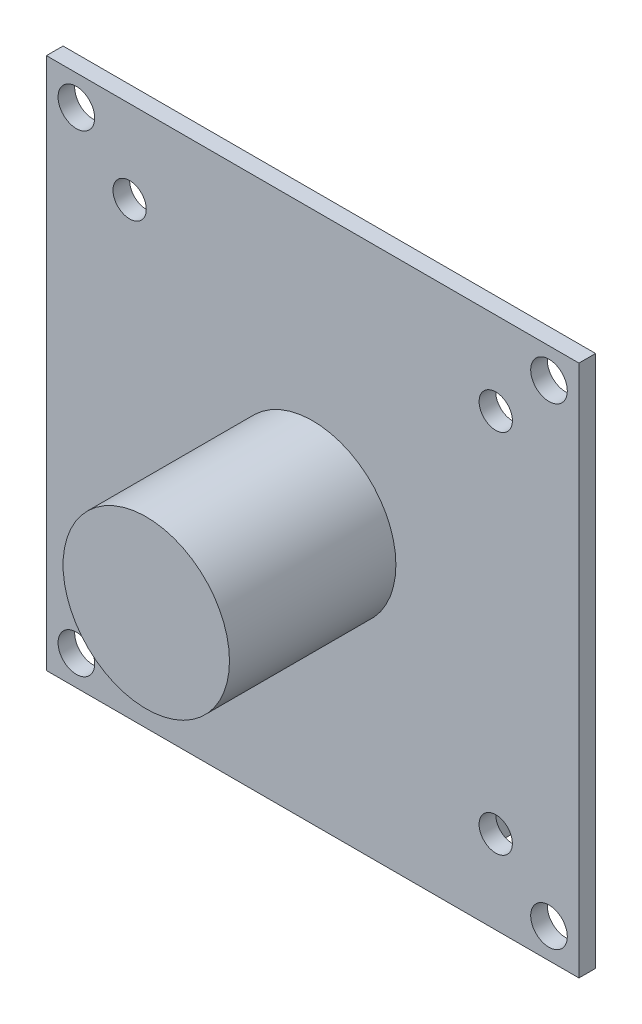
ISO-10303-21;
HEADER;
FILE_DESCRIPTION(('STEP AP214'),'2;1');
FILE_NAME('part.step','',(''),(''),'','','');
FILE_SCHEMA(('AUTOMOTIVE_DESIGN { 1 0 10303 214 1 1 1 1 }'));
ENDSEC;
DATA;
#1=APPLICATION_CONTEXT('core data for automotive mechanical design processes');
#2=APPLICATION_PROTOCOL_DEFINITION('international standard','automotive_design',2000,#1);
#3=PRODUCT_CONTEXT('',#1,'mechanical');
#4=PRODUCT('Part','Part','',(#3));
#5=PRODUCT_RELATED_PRODUCT_CATEGORY('part','',(#4));
#6=PRODUCT_DEFINITION_FORMATION('','',#4);
#7=PRODUCT_DEFINITION_CONTEXT('part definition',#1,'design');
#8=PRODUCT_DEFINITION('design','',#6,#7);
#9=PRODUCT_DEFINITION_SHAPE('','',#8);
#10=(LENGTH_UNIT() NAMED_UNIT(*) SI_UNIT(.MILLI.,.METRE.));
#11=(NAMED_UNIT(*) PLANE_ANGLE_UNIT() SI_UNIT($,.RADIAN.));
#12=(NAMED_UNIT(*) SI_UNIT($,.STERADIAN.) SOLID_ANGLE_UNIT());
#13=UNCERTAINTY_MEASURE_WITH_UNIT(LENGTH_MEASURE(1.E-05),#10,'distance_accuracy_value','');
#14=(GEOMETRIC_REPRESENTATION_CONTEXT(3) GLOBAL_UNCERTAINTY_ASSIGNED_CONTEXT((#13)) GLOBAL_UNIT_ASSIGNED_CONTEXT((#10,
#11,#12)) REPRESENTATION_CONTEXT('',''));
#15=CARTESIAN_POINT('',(0.,0.,0.));
#16=DIRECTION('',(0.,0.,1.));
#17=DIRECTION('',(1.,0.,0.));
#18=AXIS2_PLACEMENT_3D('',#15,#16,#17);
#19=CARTESIAN_POINT('',(0.,0.,0.));
#20=DIRECTION('',(0.,0.,1.));
#21=DIRECTION('',(1.,0.,0.));
#22=AXIS2_PLACEMENT_3D('',#19,#20,#21);
#23=PLANE('',#22);
#24=CARTESIAN_POINT('',(-14.2,-14.2,0.));
#25=DIRECTION('',(0.,0.,1.));
#26=DIRECTION('',(1.,0.,0.));
#27=AXIS2_PLACEMENT_3D('',#24,#25,#26);
#28=CIRCLE('',#27,1.1);
#29=CARTESIAN_POINT('',(-13.1,-14.2,0.));
#30=VERTEX_POINT('',#29);
#31=EDGE_CURVE('E327',#30,#30,#28,.T.);
#32=ORIENTED_EDGE('',*,*,#31,.T.);
#33=EDGE_LOOP('',(#32));
#34=FACE_BOUND('',#33,.T.);
#35=CARTESIAN_POINT('',(14.2,-14.2,0.));
#36=DIRECTION('',(0.,0.,1.));
#37=DIRECTION('',(1.,0.,0.));
#38=AXIS2_PLACEMENT_3D('',#35,#36,#37);
#39=CIRCLE('',#38,1.1);
#40=CARTESIAN_POINT('',(15.3,-14.2,0.));
#41=VERTEX_POINT('',#40);
#42=EDGE_CURVE('E321',#41,#41,#39,.T.);
#43=ORIENTED_EDGE('',*,*,#42,.T.);
#44=EDGE_LOOP('',(#43));
#45=FACE_BOUND('',#44,.T.);
#46=CARTESIAN_POINT('',(14.2,14.2,0.));
#47=DIRECTION('',(0.,0.,1.));
#48=DIRECTION('',(1.,0.,0.));
#49=AXIS2_PLACEMENT_3D('',#46,#47,#48);
#50=CIRCLE('',#49,1.1);
#51=CARTESIAN_POINT('',(15.3,14.2,0.));
#52=VERTEX_POINT('',#51);
#53=EDGE_CURVE('E318',#52,#52,#50,.T.);
#54=ORIENTED_EDGE('',*,*,#53,.T.);
#55=EDGE_LOOP('',(#54));
#56=FACE_BOUND('',#55,.T.);
#57=CARTESIAN_POINT('',(-14.2,14.2,0.));
#58=DIRECTION('',(0.,0.,1.));
#59=DIRECTION('',(1.,0.,0.));
#60=AXIS2_PLACEMENT_3D('',#57,#58,#59);
#61=CIRCLE('',#60,1.1);
#62=CARTESIAN_POINT('',(-13.1,14.2,0.));
#63=VERTEX_POINT('',#62);
#64=EDGE_CURVE('E322',#63,#63,#61,.T.);
#65=ORIENTED_EDGE('',*,*,#64,.T.);
#66=EDGE_LOOP('',(#65));
#67=FACE_BOUND('',#66,.T.);
#68=CARTESIAN_POINT('',(-11.,-11.,0.));
#69=DIRECTION('',(0.,0.,-1.));
#70=DIRECTION('',(-1.,0.,0.));
#71=AXIS2_PLACEMENT_3D('',#68,#69,#70);
#72=CIRCLE('',#71,1.);
#73=CARTESIAN_POINT('',(-12.,-11.,0.));
#74=VERTEX_POINT('',#73);
#75=EDGE_CURVE('E141',#74,#74,#72,.T.);
#76=ORIENTED_EDGE('',*,*,#75,.F.);
#77=EDGE_LOOP('',(#76));
#78=FACE_BOUND('',#77,.T.);
#79=CARTESIAN_POINT('',(11.,-11.,0.));
#80=DIRECTION('',(0.,0.,-1.));
#81=DIRECTION('',(-1.,0.,0.));
#82=AXIS2_PLACEMENT_3D('',#79,#80,#81);
#83=CIRCLE('',#82,1.);
#84=CARTESIAN_POINT('',(10.,-11.,0.));
#85=VERTEX_POINT('',#84);
#86=EDGE_CURVE('E156',#85,#85,#83,.T.);
#87=ORIENTED_EDGE('',*,*,#86,.F.);
#88=EDGE_LOOP('',(#87));
#89=FACE_BOUND('',#88,.T.);
#90=DIRECTION('',(0.,-1.,0.));
#91=VECTOR('',#90,1.);
#92=CARTESIAN_POINT('',(-16.,-16.,0.));
#93=LINE('',#92,#91);
#94=CARTESIAN_POINT('',(-16.,16.,0.));
#95=VERTEX_POINT('',#94);
#96=CARTESIAN_POINT('',(-16.,-16.,0.));
#97=VERTEX_POINT('',#96);
#98=EDGE_CURVE('E171',#95,#97,#93,.T.);
#99=ORIENTED_EDGE('',*,*,#98,.F.);
#100=DIRECTION('',(-1.,0.,0.));
#101=VECTOR('',#100,1.);
#102=CARTESIAN_POINT('',(16.,16.,0.));
#103=LINE('',#102,#101);
#104=CARTESIAN_POINT('',(16.,16.,0.));
#105=VERTEX_POINT('',#104);
#106=EDGE_CURVE('E180',#105,#95,#103,.T.);
#107=ORIENTED_EDGE('',*,*,#106,.F.);
#108=DIRECTION('',(0.,1.,0.));
#109=VECTOR('',#108,1.);
#110=CARTESIAN_POINT('',(16.,-16.,0.));
#111=LINE('',#110,#109);
#112=CARTESIAN_POINT('',(16.,-16.,0.));
#113=VERTEX_POINT('',#112);
#114=EDGE_CURVE('E196',#113,#105,#111,.T.);
#115=ORIENTED_EDGE('',*,*,#114,.F.);
#116=DIRECTION('',(1.,0.,0.));
#117=VECTOR('',#116,1.);
#118=CARTESIAN_POINT('',(16.,-16.,0.));
#119=LINE('',#118,#117);
#120=EDGE_CURVE('E193',#97,#113,#119,.T.);
#121=ORIENTED_EDGE('',*,*,#120,.F.);
#122=EDGE_LOOP('',(#99,#107,#115,#121));
#123=FACE_BOUND('',#122,.T.);
#124=CARTESIAN_POINT('',(-11.,11.,0.));
#125=DIRECTION('',(0.,0.,1.));
#126=DIRECTION('',(1.,0.,0.));
#127=AXIS2_PLACEMENT_3D('',#124,#125,#126);
#128=CIRCLE('',#127,1.);
#129=CARTESIAN_POINT('',(-10.,11.,0.));
#130=VERTEX_POINT('',#129);
#131=EDGE_CURVE('E167',#130,#130,#128,.T.);
#132=ORIENTED_EDGE('',*,*,#131,.T.);
#133=EDGE_LOOP('',(#132));
#134=FACE_BOUND('',#133,.T.);
#135=CARTESIAN_POINT('',(11.,11.,0.));
#136=DIRECTION('',(0.,0.,1.));
#137=DIRECTION('',(1.,0.,0.));
#138=AXIS2_PLACEMENT_3D('',#135,#136,#137);
#139=CIRCLE('',#138,1.);
#140=CARTESIAN_POINT('',(12.,11.,0.));
#141=VERTEX_POINT('',#140);
#142=EDGE_CURVE('E148',#141,#141,#139,.T.);
#143=ORIENTED_EDGE('',*,*,#142,.T.);
#144=EDGE_LOOP('',(#143));
#145=FACE_BOUND('',#144,.T.);
#146=DIRECTION('',(0.,1.,0.));
#147=VECTOR('',#146,1.);
#148=CARTESIAN_POINT('',(-2.,-10.,0.));
#149=LINE('',#148,#147);
#150=CARTESIAN_POINT('',(-2.,-14.5,0.));
#151=VERTEX_POINT('',#150);
#152=CARTESIAN_POINT('',(-2.,-10.,0.));
#153=VERTEX_POINT('',#152);
#154=EDGE_CURVE('E126',#151,#153,#149,.T.);
#155=ORIENTED_EDGE('',*,*,#154,.F.);
#156=DIRECTION('',(-1.,0.,0.));
#157=VECTOR('',#156,1.);
#158=CARTESIAN_POINT('',(8.,-14.5,0.));
#159=LINE('',#158,#157);
#160=CARTESIAN_POINT('',(8.,-14.5,0.));
#161=VERTEX_POINT('',#160);
#162=EDGE_CURVE('E123',#161,#151,#159,.T.);
#163=ORIENTED_EDGE('',*,*,#162,.F.);
#164=DIRECTION('',(0.,-1.,0.));
#165=VECTOR('',#164,1.);
#166=CARTESIAN_POINT('',(8.,-10.,0.));
#167=LINE('',#166,#165);
#168=CARTESIAN_POINT('',(8.,-10.,0.));
#169=VERTEX_POINT('',#168);
#170=EDGE_CURVE('E59',#169,#161,#167,.T.);
#171=ORIENTED_EDGE('',*,*,#170,.F.);
#172=DIRECTION('',(1.,0.,0.));
#173=VECTOR('',#172,1.);
#174=CARTESIAN_POINT('',(8.,-10.,0.));
#175=LINE('',#174,#173);
#176=EDGE_CURVE('E54',#153,#169,#175,.T.);
#177=ORIENTED_EDGE('',*,*,#176,.F.);
#178=EDGE_LOOP('',(#155,#163,#171,#177));
#179=FACE_BOUND('',#178,.T.);
#180=ADVANCED_FACE('F38',(#34,#45,#56,#67,#78,#89,#123,#134,#145,#179),#23,.F.);
#181=CARTESIAN_POINT('',(0.,0.,1.));
#182=DIRECTION('',(0.,0.,1.));
#183=DIRECTION('',(1.,0.,0.));
#184=AXIS2_PLACEMENT_3D('',#181,#182,#183);
#185=PLANE('',#184);
#186=CARTESIAN_POINT('',(-14.2,-14.2,1.));
#187=DIRECTION('',(0.,0.,1.));
#188=DIRECTION('',(-1.,0.,0.));
#189=AXIS2_PLACEMENT_3D('',#186,#187,#188);
#190=CIRCLE('',#189,1.1);
#191=CARTESIAN_POINT('',(-15.3,-14.2,1.));
#192=VERTEX_POINT('',#191);
#193=EDGE_CURVE('E359',#192,#192,#190,.T.);
#194=ORIENTED_EDGE('',*,*,#193,.F.);
#195=EDGE_LOOP('',(#194));
#196=FACE_BOUND('',#195,.T.);
#197=CARTESIAN_POINT('',(14.2,-14.2,1.));
#198=DIRECTION('',(0.,0.,1.));
#199=DIRECTION('',(1.,0.,0.));
#200=AXIS2_PLACEMENT_3D('',#197,#198,#199);
#201=CIRCLE('',#200,1.1);
#202=CARTESIAN_POINT('',(15.3,-14.2,1.));
#203=VERTEX_POINT('',#202);
#204=EDGE_CURVE('E363',#203,#203,#201,.T.);
#205=ORIENTED_EDGE('',*,*,#204,.F.);
#206=EDGE_LOOP('',(#205));
#207=FACE_BOUND('',#206,.T.);
#208=CARTESIAN_POINT('',(14.2,14.2,1.));
#209=DIRECTION('',(0.,0.,1.));
#210=DIRECTION('',(-1.,0.,0.));
#211=AXIS2_PLACEMENT_3D('',#208,#209,#210);
#212=CIRCLE('',#211,1.1);
#213=CARTESIAN_POINT('',(13.1,14.2,1.));
#214=VERTEX_POINT('',#213);
#215=EDGE_CURVE('E315',#214,#214,#212,.T.);
#216=ORIENTED_EDGE('',*,*,#215,.F.);
#217=EDGE_LOOP('',(#216));
#218=FACE_BOUND('',#217,.T.);
#219=CARTESIAN_POINT('',(-14.2,14.2,1.));
#220=DIRECTION('',(0.,0.,1.));
#221=DIRECTION('',(1.,0.,0.));
#222=AXIS2_PLACEMENT_3D('',#219,#220,#221);
#223=CIRCLE('',#222,1.1);
#224=CARTESIAN_POINT('',(-13.1,14.2,1.));
#225=VERTEX_POINT('',#224);
#226=EDGE_CURVE('E330',#225,#225,#223,.T.);
#227=ORIENTED_EDGE('',*,*,#226,.F.);
#228=EDGE_LOOP('',(#227));
#229=FACE_BOUND('',#228,.T.);
#230=CARTESIAN_POINT('',(0.,0.,1.));
#231=DIRECTION('',(0.,0.,1.));
#232=DIRECTION('',(1.,0.,0.));
#233=AXIS2_PLACEMENT_3D('',#230,#231,#232);
#234=CIRCLE('',#233,5.);
#235=CARTESIAN_POINT('',(5.,0.,1.));
#236=VERTEX_POINT('',#235);
#237=EDGE_CURVE('E128',#236,#236,#234,.T.);
#238=ORIENTED_EDGE('',*,*,#237,.F.);
#239=EDGE_LOOP('',(#238));
#240=FACE_BOUND('',#239,.T.);
#241=CARTESIAN_POINT('',(11.,-11.,1.));
#242=DIRECTION('',(0.,0.,-1.));
#243=DIRECTION('',(-1.,0.,0.));
#244=AXIS2_PLACEMENT_3D('',#241,#242,#243);
#245=CIRCLE('',#244,1.);
#246=CARTESIAN_POINT('',(10.,-11.,1.));
#247=VERTEX_POINT('',#246);
#248=EDGE_CURVE('E152',#247,#247,#245,.T.);
#249=ORIENTED_EDGE('',*,*,#248,.T.);
#250=EDGE_LOOP('',(#249));
#251=FACE_BOUND('',#250,.T.);
#252=CARTESIAN_POINT('',(11.,11.,1.));
#253=DIRECTION('',(0.,0.,1.));
#254=DIRECTION('',(1.,0.,0.));
#255=AXIS2_PLACEMENT_3D('',#252,#253,#254);
#256=CIRCLE('',#255,1.);
#257=CARTESIAN_POINT('',(12.,11.,1.));
#258=VERTEX_POINT('',#257);
#259=EDGE_CURVE('E143',#258,#258,#256,.T.);
#260=ORIENTED_EDGE('',*,*,#259,.F.);
#261=EDGE_LOOP('',(#260));
#262=FACE_BOUND('',#261,.T.);
#263=CARTESIAN_POINT('',(-11.,11.,1.));
#264=DIRECTION('',(0.,0.,1.));
#265=DIRECTION('',(1.,0.,0.));
#266=AXIS2_PLACEMENT_3D('',#263,#264,#265);
#267=CIRCLE('',#266,1.);
#268=CARTESIAN_POINT('',(-10.,11.,1.));
#269=VERTEX_POINT('',#268);
#270=EDGE_CURVE('E147',#269,#269,#267,.T.);
#271=ORIENTED_EDGE('',*,*,#270,.F.);
#272=EDGE_LOOP('',(#271));
#273=FACE_BOUND('',#272,.T.);
#274=DIRECTION('',(0.,-1.,0.));
#275=VECTOR('',#274,1.);
#276=CARTESIAN_POINT('',(-16.,-16.,1.));
#277=LINE('',#276,#275);
#278=CARTESIAN_POINT('',(-16.,16.,1.));
#279=VERTEX_POINT('',#278);
#280=CARTESIAN_POINT('',(-16.,-16.,1.));
#281=VERTEX_POINT('',#280);
#282=EDGE_CURVE('E175',#279,#281,#277,.T.);
#283=ORIENTED_EDGE('',*,*,#282,.T.);
#284=DIRECTION('',(1.,0.,0.));
#285=VECTOR('',#284,1.);
#286=CARTESIAN_POINT('',(16.,-16.,1.));
#287=LINE('',#286,#285);
#288=CARTESIAN_POINT('',(16.,-16.,1.));
#289=VERTEX_POINT('',#288);
#290=EDGE_CURVE('E179',#281,#289,#287,.T.);
#291=ORIENTED_EDGE('',*,*,#290,.T.);
#292=DIRECTION('',(0.,1.,0.));
#293=VECTOR('',#292,1.);
#294=CARTESIAN_POINT('',(16.,-16.,1.));
#295=LINE('',#294,#293);
#296=CARTESIAN_POINT('',(16.,16.,1.));
#297=VERTEX_POINT('',#296);
#298=EDGE_CURVE('E183',#289,#297,#295,.T.);
#299=ORIENTED_EDGE('',*,*,#298,.T.);
#300=DIRECTION('',(-1.,0.,0.));
#301=VECTOR('',#300,1.);
#302=CARTESIAN_POINT('',(16.,16.,1.));
#303=LINE('',#302,#301);
#304=EDGE_CURVE('E186',#297,#279,#303,.T.);
#305=ORIENTED_EDGE('',*,*,#304,.T.);
#306=EDGE_LOOP('',(#283,#291,#299,#305));
#307=FACE_BOUND('',#306,.T.);
#308=CARTESIAN_POINT('',(-11.,-11.,1.));
#309=DIRECTION('',(0.,0.,-1.));
#310=DIRECTION('',(-1.,0.,0.));
#311=AXIS2_PLACEMENT_3D('',#308,#309,#310);
#312=CIRCLE('',#311,1.);
#313=CARTESIAN_POINT('',(-12.,-11.,1.));
#314=VERTEX_POINT('',#313);
#315=EDGE_CURVE('E160',#314,#314,#312,.T.);
#316=ORIENTED_EDGE('',*,*,#315,.T.);
#317=EDGE_LOOP('',(#316));
#318=FACE_BOUND('',#317,.T.);
#319=ADVANCED_FACE('F228',(#196,#207,#218,#229,#240,#251,#262,#273,#307,#318),#185,.T.);
#320=CARTESIAN_POINT('',(-16.,-16.,1.));
#321=DIRECTION('',(1.,0.,0.));
#322=DIRECTION('',(0.,0.,-1.));
#323=AXIS2_PLACEMENT_3D('',#320,#321,#322);
#324=PLANE('',#323);
#325=ORIENTED_EDGE('',*,*,#98,.T.);
#326=DIRECTION('',(0.,0.,-1.));
#327=VECTOR('',#326,1.);
#328=CARTESIAN_POINT('',(-16.,-16.,1.));
#329=LINE('',#328,#327);
#330=EDGE_CURVE('E11',#281,#97,#329,.T.);
#331=ORIENTED_EDGE('',*,*,#330,.F.);
#332=ORIENTED_EDGE('',*,*,#282,.F.);
#333=DIRECTION('',(0.,0.,-1.));
#334=VECTOR('',#333,1.);
#335=CARTESIAN_POINT('',(-16.,16.,1.));
#336=LINE('',#335,#334);
#337=EDGE_CURVE('E189',#279,#95,#336,.T.);
#338=ORIENTED_EDGE('',*,*,#337,.T.);
#339=EDGE_LOOP('',(#325,#331,#332,#338));
#340=FACE_BOUND('',#339,.T.);
#341=ADVANCED_FACE('F40',(#340),#324,.F.);
#342=CARTESIAN_POINT('',(16.,-16.,1.));
#343=DIRECTION('',(0.,1.,0.));
#344=DIRECTION('',(-1.,0.,0.));
#345=AXIS2_PLACEMENT_3D('',#342,#343,#344);
#346=PLANE('',#345);
#347=ORIENTED_EDGE('',*,*,#120,.T.);
#348=DIRECTION('',(0.,0.,-1.));
#349=VECTOR('',#348,1.);
#350=CARTESIAN_POINT('',(16.,-16.,1.));
#351=LINE('',#350,#349);
#352=EDGE_CURVE('E47',#289,#113,#351,.T.);
#353=ORIENTED_EDGE('',*,*,#352,.F.);
#354=ORIENTED_EDGE('',*,*,#290,.F.);
#355=ORIENTED_EDGE('',*,*,#330,.T.);
#356=EDGE_LOOP('',(#347,#353,#354,#355));
#357=FACE_BOUND('',#356,.T.);
#358=ADVANCED_FACE('F230',(#357),#346,.F.);
#359=CARTESIAN_POINT('',(16.,-16.,1.));
#360=DIRECTION('',(-1.,0.,0.));
#361=DIRECTION('',(0.,0.,1.));
#362=AXIS2_PLACEMENT_3D('',#359,#360,#361);
#363=PLANE('',#362);
#364=ORIENTED_EDGE('',*,*,#114,.T.);
#365=DIRECTION('',(0.,0.,-1.));
#366=VECTOR('',#365,1.);
#367=CARTESIAN_POINT('',(16.,16.,1.));
#368=LINE('',#367,#366);
#369=EDGE_CURVE('E204',#297,#105,#368,.T.);
#370=ORIENTED_EDGE('',*,*,#369,.F.);
#371=ORIENTED_EDGE('',*,*,#298,.F.);
#372=ORIENTED_EDGE('',*,*,#352,.T.);
#373=EDGE_LOOP('',(#364,#370,#371,#372));
#374=FACE_BOUND('',#373,.T.);
#375=ADVANCED_FACE('F213',(#374),#363,.F.);
#376=CARTESIAN_POINT('',(16.,16.,1.));
#377=DIRECTION('',(0.,-1.,0.));
#378=DIRECTION('',(0.,0.,-1.));
#379=AXIS2_PLACEMENT_3D('',#376,#377,#378);
#380=PLANE('',#379);
#381=ORIENTED_EDGE('',*,*,#106,.T.);
#382=ORIENTED_EDGE('',*,*,#337,.F.);
#383=ORIENTED_EDGE('',*,*,#304,.F.);
#384=ORIENTED_EDGE('',*,*,#369,.T.);
#385=EDGE_LOOP('',(#381,#382,#383,#384));
#386=FACE_BOUND('',#385,.T.);
#387=ADVANCED_FACE('F222',(#386),#380,.F.);
#388=CARTESIAN_POINT('',(-11.,11.,0.));
#389=DIRECTION('',(0.,0.,1.));
#390=DIRECTION('',(1.,0.,0.));
#391=AXIS2_PLACEMENT_3D('',#388,#389,#390);
#392=CYLINDRICAL_SURFACE('',#391,1.);
#393=ORIENTED_EDGE('',*,*,#131,.F.);
#394=EDGE_LOOP('',(#393));
#395=FACE_BOUND('',#394,.T.);
#396=ORIENTED_EDGE('',*,*,#270,.T.);
#397=EDGE_LOOP('',(#396));
#398=FACE_BOUND('',#397,.T.);
#399=ADVANCED_FACE('F251',(#395,#398),#392,.F.);
#400=CARTESIAN_POINT('',(11.,11.,0.));
#401=DIRECTION('',(0.,0.,1.));
#402=DIRECTION('',(1.,0.,0.));
#403=AXIS2_PLACEMENT_3D('',#400,#401,#402);
#404=CYLINDRICAL_SURFACE('',#403,1.);
#405=ORIENTED_EDGE('',*,*,#142,.F.);
#406=EDGE_LOOP('',(#405));
#407=FACE_BOUND('',#406,.T.);
#408=ORIENTED_EDGE('',*,*,#259,.T.);
#409=EDGE_LOOP('',(#408));
#410=FACE_BOUND('',#409,.T.);
#411=ADVANCED_FACE('F255',(#407,#410),#404,.F.);
#412=CARTESIAN_POINT('',(11.,-11.,0.));
#413=DIRECTION('',(0.,0.,1.));
#414=DIRECTION('',(1.,0.,0.));
#415=AXIS2_PLACEMENT_3D('',#412,#413,#414);
#416=CYLINDRICAL_SURFACE('',#415,1.);
#417=ORIENTED_EDGE('',*,*,#86,.T.);
#418=EDGE_LOOP('',(#417));
#419=FACE_BOUND('',#418,.T.);
#420=ORIENTED_EDGE('',*,*,#248,.F.);
#421=EDGE_LOOP('',(#420));
#422=FACE_BOUND('',#421,.T.);
#423=ADVANCED_FACE('F260',(#419,#422),#416,.F.);
#424=CARTESIAN_POINT('',(-11.,-11.,0.));
#425=DIRECTION('',(0.,0.,1.));
#426=DIRECTION('',(1.,0.,0.));
#427=AXIS2_PLACEMENT_3D('',#424,#425,#426);
#428=CYLINDRICAL_SURFACE('',#427,1.);
#429=ORIENTED_EDGE('',*,*,#75,.T.);
#430=EDGE_LOOP('',(#429));
#431=FACE_BOUND('',#430,.T.);
#432=ORIENTED_EDGE('',*,*,#315,.F.);
#433=EDGE_LOOP('',(#432));
#434=FACE_BOUND('',#433,.T.);
#435=ADVANCED_FACE('F266',(#431,#434),#428,.F.);
#436=CARTESIAN_POINT('',(0.,0.,11.));
#437=DIRECTION('',(0.,0.,-1.));
#438=DIRECTION('',(-1.,0.,0.));
#439=AXIS2_PLACEMENT_3D('',#436,#437,#438);
#440=CYLINDRICAL_SURFACE('',#439,5.);
#441=CARTESIAN_POINT('',(0.,0.,11.));
#442=DIRECTION('',(0.,0.,1.));
#443=DIRECTION('',(1.,0.,0.));
#444=AXIS2_PLACEMENT_3D('',#441,#442,#443);
#445=CIRCLE('',#444,5.);
#446=CARTESIAN_POINT('',(5.,0.,11.));
#447=VERTEX_POINT('',#446);
#448=EDGE_CURVE('E133',#447,#447,#445,.T.);
#449=ORIENTED_EDGE('',*,*,#448,.F.);
#450=EDGE_LOOP('',(#449));
#451=FACE_BOUND('',#450,.T.);
#452=ORIENTED_EDGE('',*,*,#237,.T.);
#453=EDGE_LOOP('',(#452));
#454=FACE_BOUND('',#453,.T.);
#455=ADVANCED_FACE('F269',(#451,#454),#440,.T.);
#456=CARTESIAN_POINT('',(0.,0.,11.));
#457=DIRECTION('',(0.,0.,1.));
#458=DIRECTION('',(1.,0.,0.));
#459=AXIS2_PLACEMENT_3D('',#456,#457,#458);
#460=PLANE('',#459);
#461=ORIENTED_EDGE('',*,*,#448,.T.);
#462=EDGE_LOOP('',(#461));
#463=FACE_BOUND('',#462,.T.);
#464=ADVANCED_FACE('F276',(#463),#460,.T.);
#465=CARTESIAN_POINT('',(-2.,-10.,-6.));
#466=DIRECTION('',(1.,0.,0.));
#467=DIRECTION('',(0.,1.,0.));
#468=AXIS2_PLACEMENT_3D('',#465,#466,#467);
#469=PLANE('',#468);
#470=ORIENTED_EDGE('',*,*,#154,.T.);
#471=DIRECTION('',(0.,0.,1.));
#472=VECTOR('',#471,1.);
#473=CARTESIAN_POINT('',(-2.,-10.,-6.));
#474=LINE('',#473,#472);
#475=CARTESIAN_POINT('',(-2.,-10.,-6.));
#476=VERTEX_POINT('',#475);
#477=EDGE_CURVE('E105',#476,#153,#474,.T.);
#478=ORIENTED_EDGE('',*,*,#477,.F.);
#479=DIRECTION('',(0.,1.,0.));
#480=VECTOR('',#479,1.);
#481=CARTESIAN_POINT('',(-2.,-10.,-6.));
#482=LINE('',#481,#480);
#483=CARTESIAN_POINT('',(-2.,-14.5,-6.));
#484=VERTEX_POINT('',#483);
#485=EDGE_CURVE('E113',#484,#476,#482,.T.);
#486=ORIENTED_EDGE('',*,*,#485,.F.);
#487=DIRECTION('',(0.,0.,1.));
#488=VECTOR('',#487,1.);
#489=CARTESIAN_POINT('',(-2.,-14.5,-6.));
#490=LINE('',#489,#488);
#491=EDGE_CURVE('E340',#484,#151,#490,.T.);
#492=ORIENTED_EDGE('',*,*,#491,.T.);
#493=EDGE_LOOP('',(#470,#478,#486,#492));
#494=FACE_BOUND('',#493,.T.);
#495=ADVANCED_FACE('F125',(#494),#469,.F.);
#496=CARTESIAN_POINT('',(8.,-10.,-6.));
#497=DIRECTION('',(0.,-1.,0.));
#498=DIRECTION('',(0.,0.,-1.));
#499=AXIS2_PLACEMENT_3D('',#496,#497,#498);
#500=PLANE('',#499);
#501=ORIENTED_EDGE('',*,*,#176,.T.);
#502=DIRECTION('',(0.,0.,1.));
#503=VECTOR('',#502,1.);
#504=CARTESIAN_POINT('',(8.,-10.,-6.));
#505=LINE('',#504,#503);
#506=CARTESIAN_POINT('',(8.,-10.,-6.));
#507=VERTEX_POINT('',#506);
#508=EDGE_CURVE('E108',#507,#169,#505,.T.);
#509=ORIENTED_EDGE('',*,*,#508,.F.);
#510=DIRECTION('',(1.,0.,0.));
#511=VECTOR('',#510,1.);
#512=CARTESIAN_POINT('',(8.,-10.,-6.));
#513=LINE('',#512,#511);
#514=EDGE_CURVE('E101',#476,#507,#513,.T.);
#515=ORIENTED_EDGE('',*,*,#514,.F.);
#516=ORIENTED_EDGE('',*,*,#477,.T.);
#517=EDGE_LOOP('',(#501,#509,#515,#516));
#518=FACE_BOUND('',#517,.T.);
#519=ADVANCED_FACE('F103',(#518),#500,.F.);
#520=CARTESIAN_POINT('',(8.,-10.,-6.));
#521=DIRECTION('',(-1.,0.,0.));
#522=DIRECTION('',(0.,-1.,0.));
#523=AXIS2_PLACEMENT_3D('',#520,#521,#522);
#524=PLANE('',#523);
#525=ORIENTED_EDGE('',*,*,#170,.T.);
#526=DIRECTION('',(0.,0.,1.));
#527=VECTOR('',#526,1.);
#528=CARTESIAN_POINT('',(8.,-14.5,-6.));
#529=LINE('',#528,#527);
#530=CARTESIAN_POINT('',(8.,-14.5,-6.));
#531=VERTEX_POINT('',#530);
#532=EDGE_CURVE('E135',#531,#161,#529,.T.);
#533=ORIENTED_EDGE('',*,*,#532,.F.);
#534=DIRECTION('',(0.,-1.,0.));
#535=VECTOR('',#534,1.);
#536=CARTESIAN_POINT('',(8.,-10.,-6.));
#537=LINE('',#536,#535);
#538=EDGE_CURVE('E112',#507,#531,#537,.T.);
#539=ORIENTED_EDGE('',*,*,#538,.F.);
#540=ORIENTED_EDGE('',*,*,#508,.T.);
#541=EDGE_LOOP('',(#525,#533,#539,#540));
#542=FACE_BOUND('',#541,.T.);
#543=ADVANCED_FACE('F285',(#542),#524,.F.);
#544=CARTESIAN_POINT('',(8.,-14.5,-6.));
#545=DIRECTION('',(0.,1.,0.));
#546=DIRECTION('',(0.,0.,1.));
#547=AXIS2_PLACEMENT_3D('',#544,#545,#546);
#548=PLANE('',#547);
#549=ORIENTED_EDGE('',*,*,#162,.T.);
#550=ORIENTED_EDGE('',*,*,#491,.F.);
#551=DIRECTION('',(-1.,0.,0.));
#552=VECTOR('',#551,1.);
#553=CARTESIAN_POINT('',(8.,-14.5,-6.));
#554=LINE('',#553,#552);
#555=EDGE_CURVE('E118',#531,#484,#554,.T.);
#556=ORIENTED_EDGE('',*,*,#555,.F.);
#557=ORIENTED_EDGE('',*,*,#532,.T.);
#558=EDGE_LOOP('',(#549,#550,#556,#557));
#559=FACE_BOUND('',#558,.T.);
#560=ADVANCED_FACE('F288',(#559),#548,.F.);
#561=CARTESIAN_POINT('',(0.,0.,-6.));
#562=DIRECTION('',(0.,0.,-1.));
#563=DIRECTION('',(-1.,0.,0.));
#564=AXIS2_PLACEMENT_3D('',#561,#562,#563);
#565=PLANE('',#564);
#566=ORIENTED_EDGE('',*,*,#485,.T.);
#567=ORIENTED_EDGE('',*,*,#514,.T.);
#568=ORIENTED_EDGE('',*,*,#538,.T.);
#569=ORIENTED_EDGE('',*,*,#555,.T.);
#570=EDGE_LOOP('',(#566,#567,#568,#569));
#571=FACE_BOUND('',#570,.T.);
#572=ADVANCED_FACE('F116',(#571),#565,.T.);
#573=CARTESIAN_POINT('',(-14.2,14.2,-1.));
#574=DIRECTION('',(0.,0.,1.));
#575=DIRECTION('',(1.,0.,0.));
#576=AXIS2_PLACEMENT_3D('',#573,#574,#575);
#577=CYLINDRICAL_SURFACE('',#576,1.1);
#578=ORIENTED_EDGE('',*,*,#226,.T.);
#579=EDGE_LOOP('',(#578));
#580=FACE_BOUND('',#579,.T.);
#581=ORIENTED_EDGE('',*,*,#64,.F.);
#582=EDGE_LOOP('',(#581));
#583=FACE_BOUND('',#582,.T.);
#584=ADVANCED_FACE('F295',(#580,#583),#577,.F.);
#585=CARTESIAN_POINT('',(14.2,14.2,-1.));
#586=DIRECTION('',(0.,0.,1.));
#587=DIRECTION('',(1.,0.,0.));
#588=AXIS2_PLACEMENT_3D('',#585,#586,#587);
#589=CYLINDRICAL_SURFACE('',#588,1.1);
#590=ORIENTED_EDGE('',*,*,#215,.T.);
#591=EDGE_LOOP('',(#590));
#592=FACE_BOUND('',#591,.T.);
#593=ORIENTED_EDGE('',*,*,#53,.F.);
#594=EDGE_LOOP('',(#593));
#595=FACE_BOUND('',#594,.T.);
#596=ADVANCED_FACE('F298',(#592,#595),#589,.F.);
#597=CARTESIAN_POINT('',(14.2,-14.2,-1.));
#598=DIRECTION('',(0.,0.,1.));
#599=DIRECTION('',(1.,0.,0.));
#600=AXIS2_PLACEMENT_3D('',#597,#598,#599);
#601=CYLINDRICAL_SURFACE('',#600,1.1);
#602=ORIENTED_EDGE('',*,*,#204,.T.);
#603=EDGE_LOOP('',(#602));
#604=FACE_BOUND('',#603,.T.);
#605=ORIENTED_EDGE('',*,*,#42,.F.);
#606=EDGE_LOOP('',(#605));
#607=FACE_BOUND('',#606,.T.);
#608=ADVANCED_FACE('F303',(#604,#607),#601,.F.);
#609=CARTESIAN_POINT('',(-14.2,-14.2,-1.));
#610=DIRECTION('',(0.,0.,1.));
#611=DIRECTION('',(1.,0.,0.));
#612=AXIS2_PLACEMENT_3D('',#609,#610,#611);
#613=CYLINDRICAL_SURFACE('',#612,1.1);
#614=ORIENTED_EDGE('',*,*,#193,.T.);
#615=EDGE_LOOP('',(#614));
#616=FACE_BOUND('',#615,.T.);
#617=ORIENTED_EDGE('',*,*,#31,.F.);
#618=EDGE_LOOP('',(#617));
#619=FACE_BOUND('',#618,.T.);
#620=ADVANCED_FACE('F300',(#616,#619),#613,.F.);
#621=CLOSED_SHELL('',(#180,#319,#341,#358,#375,#387,#399,#411,#423,#435,#455,#464,#495,#519,
#543,#560,#572,#584,#596,#608,#620));
#622=MANIFOLD_SOLID_BREP('B2',#621);
#623=ADVANCED_BREP_SHAPE_REPRESENTATION('',(#18,#622),#14);
#624=SHAPE_DEFINITION_REPRESENTATION(#9,#623);
ENDSEC;
END-ISO-10303-21;
